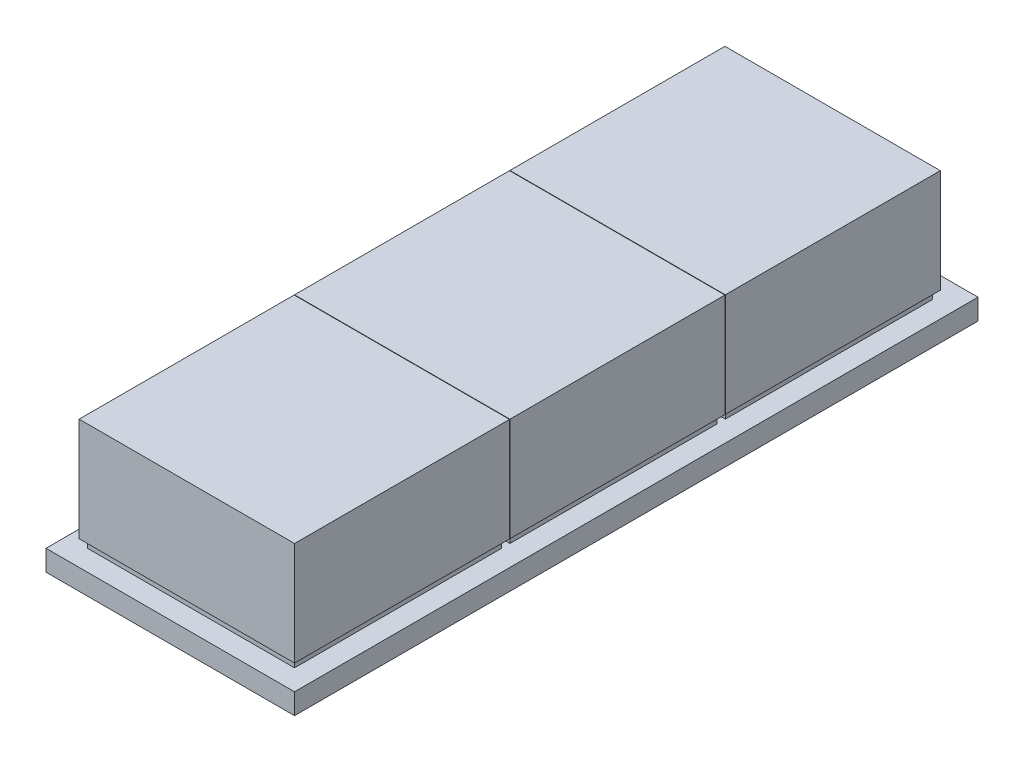
ISO-10303-21;
HEADER;
FILE_DESCRIPTION(('STEP AP214'),'2;1');
FILE_NAME('part.step','',(''),(''),'','','');
FILE_SCHEMA(('AUTOMOTIVE_DESIGN { 1 0 10303 214 1 1 1 1 }'));
ENDSEC;
DATA;
#1=APPLICATION_CONTEXT('core data for automotive mechanical design processes');
#2=APPLICATION_PROTOCOL_DEFINITION('international standard','automotive_design',2000,#1);
#3=PRODUCT_CONTEXT('',#1,'mechanical');
#4=PRODUCT('Part','Part','',(#3));
#5=PRODUCT_RELATED_PRODUCT_CATEGORY('part','',(#4));
#6=PRODUCT_DEFINITION_FORMATION('','',#4);
#7=PRODUCT_DEFINITION_CONTEXT('part definition',#1,'design');
#8=PRODUCT_DEFINITION('design','',#6,#7);
#9=PRODUCT_DEFINITION_SHAPE('','',#8);
#10=(LENGTH_UNIT() NAMED_UNIT(*) SI_UNIT(.MILLI.,.METRE.));
#11=(NAMED_UNIT(*) PLANE_ANGLE_UNIT() SI_UNIT($,.RADIAN.));
#12=(NAMED_UNIT(*) SI_UNIT($,.STERADIAN.) SOLID_ANGLE_UNIT());
#13=UNCERTAINTY_MEASURE_WITH_UNIT(LENGTH_MEASURE(1.E-05),#10,'distance_accuracy_value','');
#14=(GEOMETRIC_REPRESENTATION_CONTEXT(3) GLOBAL_UNCERTAINTY_ASSIGNED_CONTEXT((#13)) GLOBAL_UNIT_ASSIGNED_CONTEXT((#10,
#11,#12)) REPRESENTATION_CONTEXT('',''));
#15=CARTESIAN_POINT('',(0.,0.,0.));
#16=DIRECTION('',(0.,0.,1.));
#17=DIRECTION('',(1.,0.,0.));
#18=AXIS2_PLACEMENT_3D('',#15,#16,#17);
#19=CARTESIAN_POINT('',(-25.,7.,-26.5));
#20=DIRECTION('',(0.,0.,-1.));
#21=DIRECTION('',(-1.,0.,0.));
#22=AXIS2_PLACEMENT_3D('',#19,#20,#21);
#23=PLANE('',#22);
#24=DIRECTION('',(1.,0.,0.));
#25=VECTOR('',#24,1.);
#26=CARTESIAN_POINT('',(-25.,5.,-26.5));
#27=LINE('',#26,#25);
#28=CARTESIAN_POINT('',(-25.,5.,-26.5));
#29=VERTEX_POINT('',#28);
#30=CARTESIAN_POINT('',(25.,5.,-26.5));
#31=VERTEX_POINT('',#30);
#32=EDGE_CURVE('E416',#29,#31,#27,.T.);
#33=ORIENTED_EDGE('',*,*,#32,.T.);
#34=DIRECTION('',(0.,-1.,0.));
#35=VECTOR('',#34,1.);
#36=CARTESIAN_POINT('',(25.,7.,-26.5));
#37=LINE('',#36,#35);
#38=CARTESIAN_POINT('',(25.,7.,-26.5));
#39=VERTEX_POINT('',#38);
#40=EDGE_CURVE('E429',#39,#31,#37,.T.);
#41=ORIENTED_EDGE('',*,*,#40,.F.);
#42=DIRECTION('',(1.,0.,0.));
#43=VECTOR('',#42,1.);
#44=CARTESIAN_POINT('',(-25.,7.,-26.5));
#45=LINE('',#44,#43);
#46=CARTESIAN_POINT('',(-25.,7.,-26.5));
#47=VERTEX_POINT('',#46);
#48=EDGE_CURVE('E11',#47,#39,#45,.T.);
#49=ORIENTED_EDGE('',*,*,#48,.F.);
#50=DIRECTION('',(0.,-1.,0.));
#51=VECTOR('',#50,1.);
#52=CARTESIAN_POINT('',(-25.,7.,-26.5));
#53=LINE('',#52,#51);
#54=EDGE_CURVE('E49',#47,#29,#53,.T.);
#55=ORIENTED_EDGE('',*,*,#54,.T.);
#56=EDGE_LOOP('',(#33,#41,#49,#55));
#57=FACE_BOUND('',#56,.T.);
#58=ADVANCED_FACE('F35',(#57),#23,.F.);
#59=CARTESIAN_POINT('',(-25.,7.,-76.5));
#60=DIRECTION('',(1.,0.,0.));
#61=DIRECTION('',(0.,0.,-1.));
#62=AXIS2_PLACEMENT_3D('',#59,#60,#61);
#63=PLANE('',#62);
#64=DIRECTION('',(0.,0.,1.));
#65=VECTOR('',#64,1.);
#66=CARTESIAN_POINT('',(-25.,5.,-76.5));
#67=LINE('',#66,#65);
#68=CARTESIAN_POINT('',(-25.,5.,-76.5));
#69=VERTEX_POINT('',#68);
#70=EDGE_CURVE('E419',#69,#29,#67,.T.);
#71=ORIENTED_EDGE('',*,*,#70,.T.);
#72=ORIENTED_EDGE('',*,*,#54,.F.);
#73=DIRECTION('',(0.,0.,1.));
#74=VECTOR('',#73,1.);
#75=CARTESIAN_POINT('',(-25.,7.,-76.5));
#76=LINE('',#75,#74);
#77=CARTESIAN_POINT('',(-25.,7.,-76.5));
#78=VERTEX_POINT('',#77);
#79=EDGE_CURVE('E42',#78,#47,#76,.T.);
#80=ORIENTED_EDGE('',*,*,#79,.F.);
#81=DIRECTION('',(0.,-1.,0.));
#82=VECTOR('',#81,1.);
#83=CARTESIAN_POINT('',(-25.,7.,-76.5));
#84=LINE('',#83,#82);
#85=EDGE_CURVE('E57',#78,#69,#84,.T.);
#86=ORIENTED_EDGE('',*,*,#85,.T.);
#87=EDGE_LOOP('',(#71,#72,#80,#86));
#88=FACE_BOUND('',#87,.T.);
#89=ADVANCED_FACE('F439',(#88),#63,.F.);
#90=CARTESIAN_POINT('',(-25.,7.,-76.5));
#91=DIRECTION('',(0.,0.,1.));
#92=DIRECTION('',(1.,0.,0.));
#93=AXIS2_PLACEMENT_3D('',#90,#91,#92);
#94=PLANE('',#93);
#95=DIRECTION('',(-1.,0.,0.));
#96=VECTOR('',#95,1.);
#97=CARTESIAN_POINT('',(-25.,5.,-76.5));
#98=LINE('',#97,#96);
#99=CARTESIAN_POINT('',(25.,5.,-76.5));
#100=VERTEX_POINT('',#99);
#101=EDGE_CURVE('E421',#100,#69,#98,.T.);
#102=ORIENTED_EDGE('',*,*,#101,.T.);
#103=ORIENTED_EDGE('',*,*,#85,.F.);
#104=DIRECTION('',(-1.,0.,0.));
#105=VECTOR('',#104,1.);
#106=CARTESIAN_POINT('',(-25.,7.,-76.5));
#107=LINE('',#106,#105);
#108=CARTESIAN_POINT('',(25.,7.,-76.5));
#109=VERTEX_POINT('',#108);
#110=EDGE_CURVE('E433',#109,#78,#107,.T.);
#111=ORIENTED_EDGE('',*,*,#110,.F.);
#112=DIRECTION('',(0.,-1.,0.));
#113=VECTOR('',#112,1.);
#114=CARTESIAN_POINT('',(25.,7.,-76.5));
#115=LINE('',#114,#113);
#116=EDGE_CURVE('E423',#109,#100,#115,.T.);
#117=ORIENTED_EDGE('',*,*,#116,.T.);
#118=EDGE_LOOP('',(#102,#103,#111,#117));
#119=FACE_BOUND('',#118,.T.);
#120=ADVANCED_FACE('F446',(#119),#94,.F.);
#121=CARTESIAN_POINT('',(25.,7.,-76.5));
#122=DIRECTION('',(-1.,0.,0.));
#123=DIRECTION('',(0.,0.,1.));
#124=AXIS2_PLACEMENT_3D('',#121,#122,#123);
#125=PLANE('',#124);
#126=DIRECTION('',(0.,0.,-1.));
#127=VECTOR('',#126,1.);
#128=CARTESIAN_POINT('',(25.,5.,-76.5));
#129=LINE('',#128,#127);
#130=EDGE_CURVE('E414',#31,#100,#129,.T.);
#131=ORIENTED_EDGE('',*,*,#130,.T.);
#132=ORIENTED_EDGE('',*,*,#116,.F.);
#133=DIRECTION('',(0.,0.,-1.));
#134=VECTOR('',#133,1.);
#135=CARTESIAN_POINT('',(25.,7.,-76.5));
#136=LINE('',#135,#134);
#137=EDGE_CURVE('E426',#39,#109,#136,.T.);
#138=ORIENTED_EDGE('',*,*,#137,.F.);
#139=ORIENTED_EDGE('',*,*,#40,.T.);
#140=EDGE_LOOP('',(#131,#132,#138,#139));
#141=FACE_BOUND('',#140,.T.);
#142=ADVANCED_FACE('F445',(#141),#125,.F.);
#143=CARTESIAN_POINT('',(0.,5.,0.));
#144=DIRECTION('',(0.,-1.,0.));
#145=DIRECTION('',(0.,0.,-1.));
#146=AXIS2_PLACEMENT_3D('',#143,#144,#145);
#147=PLANE('',#146);
#148=DIRECTION('',(0.,0.,-1.));
#149=VECTOR('',#148,1.);
#150=CARTESIAN_POINT('',(25.,5.,27.5));
#151=LINE('',#150,#149);
#152=CARTESIAN_POINT('',(25.,5.,77.5));
#153=VERTEX_POINT('',#152);
#154=CARTESIAN_POINT('',(25.,5.,27.5));
#155=VERTEX_POINT('',#154);
#156=EDGE_CURVE('E348',#153,#155,#151,.T.);
#157=ORIENTED_EDGE('',*,*,#156,.F.);
#158=DIRECTION('',(1.,0.,0.));
#159=VECTOR('',#158,1.);
#160=CARTESIAN_POINT('',(-25.,5.,77.5));
#161=LINE('',#160,#159);
#162=CARTESIAN_POINT('',(-25.,5.,77.5));
#163=VERTEX_POINT('',#162);
#164=EDGE_CURVE('E353',#163,#153,#161,.T.);
#165=ORIENTED_EDGE('',*,*,#164,.F.);
#166=DIRECTION('',(0.,0.,1.));
#167=VECTOR('',#166,1.);
#168=CARTESIAN_POINT('',(-25.,5.,27.5));
#169=LINE('',#168,#167);
#170=CARTESIAN_POINT('',(-25.,5.,27.5));
#171=VERTEX_POINT('',#170);
#172=EDGE_CURVE('E368',#171,#163,#169,.T.);
#173=ORIENTED_EDGE('',*,*,#172,.F.);
#174=DIRECTION('',(-1.,0.,0.));
#175=VECTOR('',#174,1.);
#176=CARTESIAN_POINT('',(-25.,5.,27.5));
#177=LINE('',#176,#175);
#178=EDGE_CURVE('E365',#155,#171,#177,.T.);
#179=ORIENTED_EDGE('',*,*,#178,.F.);
#180=EDGE_LOOP('',(#157,#165,#173,#179));
#181=FACE_BOUND('',#180,.T.);
#182=DIRECTION('',(0.,0.,-1.));
#183=VECTOR('',#182,1.);
#184=CARTESIAN_POINT('',(30.,5.,82.5));
#185=LINE('',#184,#183);
#186=CARTESIAN_POINT('',(30.,5.,82.5));
#187=VERTEX_POINT('',#186);
#188=CARTESIAN_POINT('',(30.,5.,-82.5));
#189=VERTEX_POINT('',#188);
#190=EDGE_CURVE('E385',#187,#189,#185,.T.);
#191=ORIENTED_EDGE('',*,*,#190,.T.);
#192=DIRECTION('',(-1.,0.,0.));
#193=VECTOR('',#192,1.);
#194=CARTESIAN_POINT('',(-30.,5.,-82.5));
#195=LINE('',#194,#193);
#196=CARTESIAN_POINT('',(-30.,5.,-82.5));
#197=VERTEX_POINT('',#196);
#198=EDGE_CURVE('E388',#189,#197,#195,.T.);
#199=ORIENTED_EDGE('',*,*,#198,.T.);
#200=DIRECTION('',(0.,0.,1.));
#201=VECTOR('',#200,1.);
#202=CARTESIAN_POINT('',(-30.,5.,82.5));
#203=LINE('',#202,#201);
#204=CARTESIAN_POINT('',(-30.,5.,82.5));
#205=VERTEX_POINT('',#204);
#206=EDGE_CURVE('E391',#197,#205,#203,.T.);
#207=ORIENTED_EDGE('',*,*,#206,.T.);
#208=DIRECTION('',(1.,0.,0.));
#209=VECTOR('',#208,1.);
#210=CARTESIAN_POINT('',(-30.,5.,82.5));
#211=LINE('',#210,#209);
#212=EDGE_CURVE('E393',#205,#187,#211,.T.);
#213=ORIENTED_EDGE('',*,*,#212,.T.);
#214=EDGE_LOOP('',(#191,#199,#207,#213));
#215=FACE_BOUND('',#214,.T.);
#216=DIRECTION('',(0.,0.,-1.));
#217=VECTOR('',#216,1.);
#218=CARTESIAN_POINT('',(25.,5.,-24.5));
#219=LINE('',#218,#217);
#220=CARTESIAN_POINT('',(25.,5.,25.5));
#221=VERTEX_POINT('',#220);
#222=CARTESIAN_POINT('',(25.,5.,-24.5));
#223=VERTEX_POINT('',#222);
#224=EDGE_CURVE('E345',#221,#223,#219,.T.);
#225=ORIENTED_EDGE('',*,*,#224,.F.);
#226=DIRECTION('',(1.,0.,0.));
#227=VECTOR('',#226,1.);
#228=CARTESIAN_POINT('',(-25.,5.,25.5));
#229=LINE('',#228,#227);
#230=CARTESIAN_POINT('',(-25.,5.,25.5));
#231=VERTEX_POINT('',#230);
#232=EDGE_CURVE('E312',#231,#221,#229,.T.);
#233=ORIENTED_EDGE('',*,*,#232,.F.);
#234=DIRECTION('',(0.,0.,1.));
#235=VECTOR('',#234,1.);
#236=CARTESIAN_POINT('',(-25.,5.,-24.5));
#237=LINE('',#236,#235);
#238=CARTESIAN_POINT('',(-25.,5.,-24.5));
#239=VERTEX_POINT('',#238);
#240=EDGE_CURVE('E333',#239,#231,#237,.T.);
#241=ORIENTED_EDGE('',*,*,#240,.F.);
#242=DIRECTION('',(-1.,0.,0.));
#243=VECTOR('',#242,1.);
#244=CARTESIAN_POINT('',(-25.,5.,-24.5));
#245=LINE('',#244,#243);
#246=EDGE_CURVE('E339',#223,#239,#245,.T.);
#247=ORIENTED_EDGE('',*,*,#246,.F.);
#248=EDGE_LOOP('',(#225,#233,#241,#247));
#249=FACE_BOUND('',#248,.T.);
#250=ORIENTED_EDGE('',*,*,#130,.F.);
#251=ORIENTED_EDGE('',*,*,#32,.F.);
#252=ORIENTED_EDGE('',*,*,#70,.F.);
#253=ORIENTED_EDGE('',*,*,#101,.F.);
#254=EDGE_LOOP('',(#250,#251,#252,#253));
#255=FACE_BOUND('',#254,.T.);
#256=ADVANCED_FACE('F453',(#181,#215,#249,#255),#147,.F.);
#257=CARTESIAN_POINT('',(30.,5.,82.5));
#258=DIRECTION('',(-1.,0.,0.));
#259=DIRECTION('',(0.,0.,1.));
#260=AXIS2_PLACEMENT_3D('',#257,#258,#259);
#261=PLANE('',#260);
#262=DIRECTION('',(0.,0.,-1.));
#263=VECTOR('',#262,1.);
#264=CARTESIAN_POINT('',(30.,0.,82.5));
#265=LINE('',#264,#263);
#266=CARTESIAN_POINT('',(30.,0.,82.5));
#267=VERTEX_POINT('',#266);
#268=CARTESIAN_POINT('',(30.,0.,-82.5));
#269=VERTEX_POINT('',#268);
#270=EDGE_CURVE('E384',#267,#269,#265,.T.);
#271=ORIENTED_EDGE('',*,*,#270,.T.);
#272=DIRECTION('',(0.,-1.,0.));
#273=VECTOR('',#272,1.);
#274=CARTESIAN_POINT('',(30.,5.,-82.5));
#275=LINE('',#274,#273);
#276=EDGE_CURVE('E411',#189,#269,#275,.T.);
#277=ORIENTED_EDGE('',*,*,#276,.F.);
#278=ORIENTED_EDGE('',*,*,#190,.F.);
#279=DIRECTION('',(0.,-1.,0.));
#280=VECTOR('',#279,1.);
#281=CARTESIAN_POINT('',(30.,5.,82.5));
#282=LINE('',#281,#280);
#283=EDGE_CURVE('E395',#187,#267,#282,.T.);
#284=ORIENTED_EDGE('',*,*,#283,.T.);
#285=EDGE_LOOP('',(#271,#277,#278,#284));
#286=FACE_BOUND('',#285,.T.);
#287=ADVANCED_FACE('F734',(#286),#261,.F.);
#288=CARTESIAN_POINT('',(-30.,5.,-82.5));
#289=DIRECTION('',(0.,0.,1.));
#290=DIRECTION('',(1.,0.,0.));
#291=AXIS2_PLACEMENT_3D('',#288,#289,#290);
#292=PLANE('',#291);
#293=DIRECTION('',(-1.,0.,0.));
#294=VECTOR('',#293,1.);
#295=CARTESIAN_POINT('',(-30.,0.,-82.5));
#296=LINE('',#295,#294);
#297=CARTESIAN_POINT('',(-30.,0.,-82.5));
#298=VERTEX_POINT('',#297);
#299=EDGE_CURVE('E398',#269,#298,#296,.T.);
#300=ORIENTED_EDGE('',*,*,#299,.T.);
#301=DIRECTION('',(0.,-1.,0.));
#302=VECTOR('',#301,1.);
#303=CARTESIAN_POINT('',(-30.,5.,-82.5));
#304=LINE('',#303,#302);
#305=EDGE_CURVE('E408',#197,#298,#304,.T.);
#306=ORIENTED_EDGE('',*,*,#305,.F.);
#307=ORIENTED_EDGE('',*,*,#198,.F.);
#308=ORIENTED_EDGE('',*,*,#276,.T.);
#309=EDGE_LOOP('',(#300,#306,#307,#308));
#310=FACE_BOUND('',#309,.T.);
#311=ADVANCED_FACE('F795',(#310),#292,.F.);
#312=CARTESIAN_POINT('',(-30.,5.,82.5));
#313=DIRECTION('',(1.,0.,0.));
#314=DIRECTION('',(0.,0.,-1.));
#315=AXIS2_PLACEMENT_3D('',#312,#313,#314);
#316=PLANE('',#315);
#317=DIRECTION('',(0.,0.,1.));
#318=VECTOR('',#317,1.);
#319=CARTESIAN_POINT('',(-30.,0.,82.5));
#320=LINE('',#319,#318);
#321=CARTESIAN_POINT('',(-30.,0.,82.5));
#322=VERTEX_POINT('',#321);
#323=EDGE_CURVE('E400',#298,#322,#320,.T.);
#324=ORIENTED_EDGE('',*,*,#323,.T.);
#325=DIRECTION('',(0.,-1.,0.));
#326=VECTOR('',#325,1.);
#327=CARTESIAN_POINT('',(-30.,5.,82.5));
#328=LINE('',#327,#326);
#329=EDGE_CURVE('E405',#205,#322,#328,.T.);
#330=ORIENTED_EDGE('',*,*,#329,.F.);
#331=ORIENTED_EDGE('',*,*,#206,.F.);
#332=ORIENTED_EDGE('',*,*,#305,.T.);
#333=EDGE_LOOP('',(#324,#330,#331,#332));
#334=FACE_BOUND('',#333,.T.);
#335=ADVANCED_FACE('F786',(#334),#316,.F.);
#336=CARTESIAN_POINT('',(-30.,5.,82.5));
#337=DIRECTION('',(0.,0.,-1.));
#338=DIRECTION('',(-1.,0.,0.));
#339=AXIS2_PLACEMENT_3D('',#336,#337,#338);
#340=PLANE('',#339);
#341=DIRECTION('',(1.,0.,0.));
#342=VECTOR('',#341,1.);
#343=CARTESIAN_POINT('',(-30.,0.,82.5));
#344=LINE('',#343,#342);
#345=EDGE_CURVE('E389',#322,#267,#344,.T.);
#346=ORIENTED_EDGE('',*,*,#345,.T.);
#347=ORIENTED_EDGE('',*,*,#283,.F.);
#348=ORIENTED_EDGE('',*,*,#212,.F.);
#349=ORIENTED_EDGE('',*,*,#329,.T.);
#350=EDGE_LOOP('',(#346,#347,#348,#349));
#351=FACE_BOUND('',#350,.T.);
#352=ADVANCED_FACE('F777',(#351),#340,.F.);
#353=CARTESIAN_POINT('',(0.,0.,0.));
#354=DIRECTION('',(0.,-1.,0.));
#355=DIRECTION('',(0.,0.,-1.));
#356=AXIS2_PLACEMENT_3D('',#353,#354,#355);
#357=PLANE('',#356);
#358=ORIENTED_EDGE('',*,*,#270,.F.);
#359=ORIENTED_EDGE('',*,*,#345,.F.);
#360=ORIENTED_EDGE('',*,*,#323,.F.);
#361=ORIENTED_EDGE('',*,*,#299,.F.);
#362=EDGE_LOOP('',(#358,#359,#360,#361));
#363=FACE_BOUND('',#362,.T.);
#364=ADVANCED_FACE('F769',(#363),#357,.T.);
#365=CARTESIAN_POINT('',(25.,7.,27.5));
#366=DIRECTION('',(-1.,0.,0.));
#367=DIRECTION('',(0.,0.,1.));
#368=AXIS2_PLACEMENT_3D('',#365,#366,#367);
#369=PLANE('',#368);
#370=ORIENTED_EDGE('',*,*,#156,.T.);
#371=DIRECTION('',(0.,-1.,0.));
#372=VECTOR('',#371,1.);
#373=CARTESIAN_POINT('',(25.,7.,27.5));
#374=LINE('',#373,#372);
#375=CARTESIAN_POINT('',(25.,7.,27.5));
#376=VERTEX_POINT('',#375);
#377=EDGE_CURVE('E381',#376,#155,#374,.T.);
#378=ORIENTED_EDGE('',*,*,#377,.F.);
#379=DIRECTION('',(0.,0.,-1.));
#380=VECTOR('',#379,1.);
#381=CARTESIAN_POINT('',(25.,7.,27.5));
#382=LINE('',#381,#380);
#383=CARTESIAN_POINT('',(25.,7.,77.5));
#384=VERTEX_POINT('',#383);
#385=EDGE_CURVE('E349',#384,#376,#382,.T.);
#386=ORIENTED_EDGE('',*,*,#385,.F.);
#387=DIRECTION('',(0.,-1.,0.));
#388=VECTOR('',#387,1.);
#389=CARTESIAN_POINT('',(25.,7.,77.5));
#390=LINE('',#389,#388);
#391=EDGE_CURVE('E362',#384,#153,#390,.T.);
#392=ORIENTED_EDGE('',*,*,#391,.T.);
#393=EDGE_LOOP('',(#370,#378,#386,#392));
#394=FACE_BOUND('',#393,.T.);
#395=ADVANCED_FACE('F761',(#394),#369,.F.);
#396=CARTESIAN_POINT('',(-25.,7.,27.5));
#397=DIRECTION('',(0.,0.,1.));
#398=DIRECTION('',(1.,0.,0.));
#399=AXIS2_PLACEMENT_3D('',#396,#397,#398);
#400=PLANE('',#399);
#401=ORIENTED_EDGE('',*,*,#178,.T.);
#402=DIRECTION('',(0.,-1.,0.));
#403=VECTOR('',#402,1.);
#404=CARTESIAN_POINT('',(-25.,7.,27.5));
#405=LINE('',#404,#403);
#406=CARTESIAN_POINT('',(-25.,7.,27.5));
#407=VERTEX_POINT('',#406);
#408=EDGE_CURVE('E378',#407,#171,#405,.T.);
#409=ORIENTED_EDGE('',*,*,#408,.F.);
#410=DIRECTION('',(-1.,0.,0.));
#411=VECTOR('',#410,1.);
#412=CARTESIAN_POINT('',(-25.,7.,27.5));
#413=LINE('',#412,#411);
#414=EDGE_CURVE('E352',#376,#407,#413,.T.);
#415=ORIENTED_EDGE('',*,*,#414,.F.);
#416=ORIENTED_EDGE('',*,*,#377,.T.);
#417=EDGE_LOOP('',(#401,#409,#415,#416));
#418=FACE_BOUND('',#417,.T.);
#419=ADVANCED_FACE('F752',(#418),#400,.F.);
#420=CARTESIAN_POINT('',(-25.,7.,27.5));
#421=DIRECTION('',(1.,0.,0.));
#422=DIRECTION('',(0.,0.,-1.));
#423=AXIS2_PLACEMENT_3D('',#420,#421,#422);
#424=PLANE('',#423);
#425=ORIENTED_EDGE('',*,*,#172,.T.);
#426=DIRECTION('',(0.,-1.,0.));
#427=VECTOR('',#426,1.);
#428=CARTESIAN_POINT('',(-25.,7.,77.5));
#429=LINE('',#428,#427);
#430=CARTESIAN_POINT('',(-25.,7.,77.5));
#431=VERTEX_POINT('',#430);
#432=EDGE_CURVE('E375',#431,#163,#429,.T.);
#433=ORIENTED_EDGE('',*,*,#432,.F.);
#434=DIRECTION('',(0.,0.,1.));
#435=VECTOR('',#434,1.);
#436=CARTESIAN_POINT('',(-25.,7.,27.5));
#437=LINE('',#436,#435);
#438=EDGE_CURVE('E356',#407,#431,#437,.T.);
#439=ORIENTED_EDGE('',*,*,#438,.F.);
#440=ORIENTED_EDGE('',*,*,#408,.T.);
#441=EDGE_LOOP('',(#425,#433,#439,#440));
#442=FACE_BOUND('',#441,.T.);
#443=ADVANCED_FACE('F743',(#442),#424,.F.);
#444=CARTESIAN_POINT('',(-25.,7.,77.5));
#445=DIRECTION('',(0.,0.,-1.));
#446=DIRECTION('',(-1.,0.,0.));
#447=AXIS2_PLACEMENT_3D('',#444,#445,#446);
#448=PLANE('',#447);
#449=ORIENTED_EDGE('',*,*,#164,.T.);
#450=ORIENTED_EDGE('',*,*,#391,.F.);
#451=DIRECTION('',(1.,0.,0.));
#452=VECTOR('',#451,1.);
#453=CARTESIAN_POINT('',(-25.,7.,77.5));
#454=LINE('',#453,#452);
#455=EDGE_CURVE('E359',#431,#384,#454,.T.);
#456=ORIENTED_EDGE('',*,*,#455,.F.);
#457=ORIENTED_EDGE('',*,*,#432,.T.);
#458=EDGE_LOOP('',(#449,#450,#456,#457));
#459=FACE_BOUND('',#458,.T.);
#460=ADVANCED_FACE('F480',(#459),#448,.F.);
#461=CARTESIAN_POINT('',(25.,7.,-24.5));
#462=DIRECTION('',(-1.,0.,0.));
#463=DIRECTION('',(0.,0.,1.));
#464=AXIS2_PLACEMENT_3D('',#461,#462,#463);
#465=PLANE('',#464);
#466=ORIENTED_EDGE('',*,*,#224,.T.);
#467=DIRECTION('',(0.,-1.,0.));
#468=VECTOR('',#467,1.);
#469=CARTESIAN_POINT('',(25.,7.,-24.5));
#470=LINE('',#469,#468);
#471=CARTESIAN_POINT('',(25.,7.,-24.5));
#472=VERTEX_POINT('',#471);
#473=EDGE_CURVE('E342',#472,#223,#470,.T.);
#474=ORIENTED_EDGE('',*,*,#473,.F.);
#475=DIRECTION('',(0.,0.,-1.));
#476=VECTOR('',#475,1.);
#477=CARTESIAN_POINT('',(25.,7.,-24.5));
#478=LINE('',#477,#476);
#479=CARTESIAN_POINT('',(25.,7.,25.5));
#480=VERTEX_POINT('',#479);
#481=EDGE_CURVE('E315',#480,#472,#478,.T.);
#482=ORIENTED_EDGE('',*,*,#481,.F.);
#483=DIRECTION('',(0.,-1.,0.));
#484=VECTOR('',#483,1.);
#485=CARTESIAN_POINT('',(25.,7.,25.5));
#486=LINE('',#485,#484);
#487=EDGE_CURVE('E327',#480,#221,#486,.T.);
#488=ORIENTED_EDGE('',*,*,#487,.T.);
#489=EDGE_LOOP('',(#466,#474,#482,#488));
#490=FACE_BOUND('',#489,.T.);
#491=ADVANCED_FACE('F474',(#490),#465,.F.);
#492=CARTESIAN_POINT('',(-25.,7.,-24.5));
#493=DIRECTION('',(0.,0.,1.));
#494=DIRECTION('',(1.,0.,0.));
#495=AXIS2_PLACEMENT_3D('',#492,#493,#494);
#496=PLANE('',#495);
#497=ORIENTED_EDGE('',*,*,#246,.T.);
#498=DIRECTION('',(0.,-1.,0.));
#499=VECTOR('',#498,1.);
#500=CARTESIAN_POINT('',(-25.,7.,-24.5));
#501=LINE('',#500,#499);
#502=CARTESIAN_POINT('',(-25.,7.,-24.5));
#503=VERTEX_POINT('',#502);
#504=EDGE_CURVE('E336',#503,#239,#501,.T.);
#505=ORIENTED_EDGE('',*,*,#504,.F.);
#506=DIRECTION('',(-1.,0.,0.));
#507=VECTOR('',#506,1.);
#508=CARTESIAN_POINT('',(-25.,7.,-24.5));
#509=LINE('',#508,#507);
#510=EDGE_CURVE('E318',#472,#503,#509,.T.);
#511=ORIENTED_EDGE('',*,*,#510,.F.);
#512=ORIENTED_EDGE('',*,*,#473,.T.);
#513=EDGE_LOOP('',(#497,#505,#511,#512));
#514=FACE_BOUND('',#513,.T.);
#515=ADVANCED_FACE('F479',(#514),#496,.F.);
#516=CARTESIAN_POINT('',(-25.,7.,-24.5));
#517=DIRECTION('',(1.,0.,0.));
#518=DIRECTION('',(0.,0.,-1.));
#519=AXIS2_PLACEMENT_3D('',#516,#517,#518);
#520=PLANE('',#519);
#521=ORIENTED_EDGE('',*,*,#240,.T.);
#522=DIRECTION('',(0.,-1.,0.));
#523=VECTOR('',#522,1.);
#524=CARTESIAN_POINT('',(-25.,7.,25.5));
#525=LINE('',#524,#523);
#526=CARTESIAN_POINT('',(-25.,7.,25.5));
#527=VERTEX_POINT('',#526);
#528=EDGE_CURVE('E330',#527,#231,#525,.T.);
#529=ORIENTED_EDGE('',*,*,#528,.F.);
#530=DIRECTION('',(0.,0.,1.));
#531=VECTOR('',#530,1.);
#532=CARTESIAN_POINT('',(-25.,7.,-24.5));
#533=LINE('',#532,#531);
#534=EDGE_CURVE('E321',#503,#527,#533,.T.);
#535=ORIENTED_EDGE('',*,*,#534,.F.);
#536=ORIENTED_EDGE('',*,*,#504,.T.);
#537=EDGE_LOOP('',(#521,#529,#535,#536));
#538=FACE_BOUND('',#537,.T.);
#539=ADVANCED_FACE('F489',(#538),#520,.F.);
#540=CARTESIAN_POINT('',(-25.,7.,25.5));
#541=DIRECTION('',(0.,0.,-1.));
#542=DIRECTION('',(-1.,0.,0.));
#543=AXIS2_PLACEMENT_3D('',#540,#541,#542);
#544=PLANE('',#543);
#545=ORIENTED_EDGE('',*,*,#232,.T.);
#546=ORIENTED_EDGE('',*,*,#487,.F.);
#547=DIRECTION('',(1.,0.,0.));
#548=VECTOR('',#547,1.);
#549=CARTESIAN_POINT('',(-25.,7.,25.5));
#550=LINE('',#549,#548);
#551=EDGE_CURVE('E324',#527,#480,#550,.T.);
#552=ORIENTED_EDGE('',*,*,#551,.F.);
#553=ORIENTED_EDGE('',*,*,#528,.T.);
#554=EDGE_LOOP('',(#545,#546,#552,#553));
#555=FACE_BOUND('',#554,.T.);
#556=ADVANCED_FACE('F494',(#555),#544,.F.);
#557=CARTESIAN_POINT('',(0.,7.,0.));
#558=DIRECTION('',(0.,1.,0.));
#559=DIRECTION('',(0.,0.,1.));
#560=AXIS2_PLACEMENT_3D('',#557,#558,#559);
#561=PLANE('',#560);
#562=DIRECTION('',(0.,0.,-1.));
#563=VECTOR('',#562,1.);
#564=CARTESIAN_POINT('',(26.,7.,26.6));
#565=LINE('',#564,#563);
#566=CARTESIAN_POINT('',(26.,7.,78.5));
#567=VERTEX_POINT('',#566);
#568=CARTESIAN_POINT('',(26.,7.,26.6));
#569=VERTEX_POINT('',#568);
#570=EDGE_CURVE('E282',#567,#569,#565,.T.);
#571=ORIENTED_EDGE('',*,*,#570,.F.);
#572=DIRECTION('',(1.,0.,0.));
#573=VECTOR('',#572,1.);
#574=CARTESIAN_POINT('',(-26.,7.,78.5));
#575=LINE('',#574,#573);
#576=CARTESIAN_POINT('',(-26.,7.,78.5));
#577=VERTEX_POINT('',#576);
#578=EDGE_CURVE('E287',#577,#567,#575,.T.);
#579=ORIENTED_EDGE('',*,*,#578,.F.);
#580=DIRECTION('',(0.,0.,1.));
#581=VECTOR('',#580,1.);
#582=CARTESIAN_POINT('',(-26.,7.,26.6));
#583=LINE('',#582,#581);
#584=CARTESIAN_POINT('',(-26.,7.,26.6));
#585=VERTEX_POINT('',#584);
#586=EDGE_CURVE('E298',#585,#577,#583,.T.);
#587=ORIENTED_EDGE('',*,*,#586,.F.);
#588=DIRECTION('',(-1.,0.,0.));
#589=VECTOR('',#588,1.);
#590=CARTESIAN_POINT('',(-26.,7.,26.6));
#591=LINE('',#590,#589);
#592=EDGE_CURVE('E296',#569,#585,#591,.T.);
#593=ORIENTED_EDGE('',*,*,#592,.F.);
#594=EDGE_LOOP('',(#571,#579,#587,#593));
#595=FACE_BOUND('',#594,.T.);
#596=ORIENTED_EDGE('',*,*,#455,.T.);
#597=ORIENTED_EDGE('',*,*,#385,.T.);
#598=ORIENTED_EDGE('',*,*,#414,.T.);
#599=ORIENTED_EDGE('',*,*,#438,.T.);
#600=EDGE_LOOP('',(#596,#597,#598,#599));
#601=FACE_BOUND('',#600,.T.);
#602=ADVANCED_FACE('F620',(#595,#601),#561,.F.);
#603=CARTESIAN_POINT('',(26.,32.,26.6));
#604=DIRECTION('',(-1.,0.,0.));
#605=DIRECTION('',(0.,0.,1.));
#606=AXIS2_PLACEMENT_3D('',#603,#604,#605);
#607=PLANE('',#606);
#608=ORIENTED_EDGE('',*,*,#570,.T.);
#609=DIRECTION('',(0.,-1.,0.));
#610=VECTOR('',#609,1.);
#611=CARTESIAN_POINT('',(26.,32.,26.6));
#612=LINE('',#611,#610);
#613=CARTESIAN_POINT('',(26.,32.,26.6));
#614=VERTEX_POINT('',#613);
#615=EDGE_CURVE('E309',#614,#569,#612,.T.);
#616=ORIENTED_EDGE('',*,*,#615,.F.);
#617=DIRECTION('',(0.,0.,-1.));
#618=VECTOR('',#617,1.);
#619=CARTESIAN_POINT('',(26.,32.,26.6));
#620=LINE('',#619,#618);
#621=CARTESIAN_POINT('',(26.,32.,78.5));
#622=VERTEX_POINT('',#621);
#623=EDGE_CURVE('E283',#622,#614,#620,.T.);
#624=ORIENTED_EDGE('',*,*,#623,.F.);
#625=DIRECTION('',(0.,-1.,0.));
#626=VECTOR('',#625,1.);
#627=CARTESIAN_POINT('',(26.,32.,78.5));
#628=LINE('',#627,#626);
#629=EDGE_CURVE('E293',#622,#567,#628,.T.);
#630=ORIENTED_EDGE('',*,*,#629,.T.);
#631=EDGE_LOOP('',(#608,#616,#624,#630));
#632=FACE_BOUND('',#631,.T.);
#633=ADVANCED_FACE('F689',(#632),#607,.F.);
#634=CARTESIAN_POINT('',(-26.,32.,26.6));
#635=DIRECTION('',(0.,0.,1.));
#636=DIRECTION('',(1.,0.,0.));
#637=AXIS2_PLACEMENT_3D('',#634,#635,#636);
#638=PLANE('',#637);
#639=ORIENTED_EDGE('',*,*,#592,.T.);
#640=DIRECTION('',(0.,-1.,0.));
#641=VECTOR('',#640,1.);
#642=CARTESIAN_POINT('',(-26.,32.,26.6));
#643=LINE('',#642,#641);
#644=CARTESIAN_POINT('',(-26.,32.,26.6));
#645=VERTEX_POINT('',#644);
#646=EDGE_CURVE('E306',#645,#585,#643,.T.);
#647=ORIENTED_EDGE('',*,*,#646,.F.);
#648=DIRECTION('',(-1.,0.,0.));
#649=VECTOR('',#648,1.);
#650=CARTESIAN_POINT('',(-26.,32.,26.6));
#651=LINE('',#650,#649);
#652=EDGE_CURVE('E286',#614,#645,#651,.T.);
#653=ORIENTED_EDGE('',*,*,#652,.F.);
#654=ORIENTED_EDGE('',*,*,#615,.T.);
#655=EDGE_LOOP('',(#639,#647,#653,#654));
#656=FACE_BOUND('',#655,.T.);
#657=ADVANCED_FACE('F680',(#656),#638,.F.);
#658=CARTESIAN_POINT('',(-26.,32.,26.6));
#659=DIRECTION('',(1.,0.,0.));
#660=DIRECTION('',(0.,0.,-1.));
#661=AXIS2_PLACEMENT_3D('',#658,#659,#660);
#662=PLANE('',#661);
#663=ORIENTED_EDGE('',*,*,#586,.T.);
#664=DIRECTION('',(0.,-1.,0.));
#665=VECTOR('',#664,1.);
#666=CARTESIAN_POINT('',(-26.,32.,78.5));
#667=LINE('',#666,#665);
#668=CARTESIAN_POINT('',(-26.,32.,78.5));
#669=VERTEX_POINT('',#668);
#670=EDGE_CURVE('E303',#669,#577,#667,.T.);
#671=ORIENTED_EDGE('',*,*,#670,.F.);
#672=DIRECTION('',(0.,0.,1.));
#673=VECTOR('',#672,1.);
#674=CARTESIAN_POINT('',(-26.,32.,26.6));
#675=LINE('',#674,#673);
#676=EDGE_CURVE('E289',#645,#669,#675,.T.);
#677=ORIENTED_EDGE('',*,*,#676,.F.);
#678=ORIENTED_EDGE('',*,*,#646,.T.);
#679=EDGE_LOOP('',(#663,#671,#677,#678));
#680=FACE_BOUND('',#679,.T.);
#681=ADVANCED_FACE('F671',(#680),#662,.F.);
#682=CARTESIAN_POINT('',(-26.,32.,78.5));
#683=DIRECTION('',(0.,0.,-1.));
#684=DIRECTION('',(-1.,0.,0.));
#685=AXIS2_PLACEMENT_3D('',#682,#683,#684);
#686=PLANE('',#685);
#687=ORIENTED_EDGE('',*,*,#578,.T.);
#688=ORIENTED_EDGE('',*,*,#629,.F.);
#689=DIRECTION('',(1.,0.,0.));
#690=VECTOR('',#689,1.);
#691=CARTESIAN_POINT('',(-26.,32.,78.5));
#692=LINE('',#691,#690);
#693=EDGE_CURVE('E291',#669,#622,#692,.T.);
#694=ORIENTED_EDGE('',*,*,#693,.F.);
#695=ORIENTED_EDGE('',*,*,#670,.T.);
#696=EDGE_LOOP('',(#687,#688,#694,#695));
#697=FACE_BOUND('',#696,.T.);
#698=ADVANCED_FACE('F662',(#697),#686,.F.);
#699=CARTESIAN_POINT('',(0.,32.,0.));
#700=DIRECTION('',(0.,1.,0.));
#701=DIRECTION('',(0.,0.,1.));
#702=AXIS2_PLACEMENT_3D('',#699,#700,#701);
#703=PLANE('',#702);
#704=ORIENTED_EDGE('',*,*,#623,.T.);
#705=ORIENTED_EDGE('',*,*,#652,.T.);
#706=ORIENTED_EDGE('',*,*,#676,.T.);
#707=ORIENTED_EDGE('',*,*,#693,.T.);
#708=EDGE_LOOP('',(#704,#705,#706,#707));
#709=FACE_BOUND('',#708,.T.);
#710=ADVANCED_FACE('F575',(#709),#703,.T.);
#711=CARTESIAN_POINT('',(0.,7.,-52.));
#712=DIRECTION('',(0.,1.,0.));
#713=DIRECTION('',(0.,0.,1.));
#714=AXIS2_PLACEMENT_3D('',#711,#712,#713);
#715=PLANE('',#714);
#716=DIRECTION('',(0.,0.,-1.));
#717=VECTOR('',#716,1.);
#718=CARTESIAN_POINT('',(26.,7.,-25.4));
#719=LINE('',#718,#717);
#720=CARTESIAN_POINT('',(26.,7.,26.5));
#721=VERTEX_POINT('',#720);
#722=CARTESIAN_POINT('',(26.,7.,-25.4));
#723=VERTEX_POINT('',#722);
#724=EDGE_CURVE('E247',#721,#723,#719,.T.);
#725=ORIENTED_EDGE('',*,*,#724,.F.);
#726=DIRECTION('',(1.,0.,0.));
#727=VECTOR('',#726,1.);
#728=CARTESIAN_POINT('',(-26.,7.,26.5));
#729=LINE('',#728,#727);
#730=CARTESIAN_POINT('',(-26.,7.,26.5));
#731=VERTEX_POINT('',#730);
#732=EDGE_CURVE('E260',#731,#721,#729,.T.);
#733=ORIENTED_EDGE('',*,*,#732,.F.);
#734=DIRECTION('',(0.,0.,1.));
#735=VECTOR('',#734,1.);
#736=CARTESIAN_POINT('',(-26.,7.,-25.4));
#737=LINE('',#736,#735);
#738=CARTESIAN_POINT('',(-26.,7.,-25.4));
#739=VERTEX_POINT('',#738);
#740=EDGE_CURVE('E268',#739,#731,#737,.T.);
#741=ORIENTED_EDGE('',*,*,#740,.F.);
#742=DIRECTION('',(-1.,0.,0.));
#743=VECTOR('',#742,1.);
#744=CARTESIAN_POINT('',(-26.,7.,-25.4));
#745=LINE('',#744,#743);
#746=EDGE_CURVE('E250',#723,#739,#745,.T.);
#747=ORIENTED_EDGE('',*,*,#746,.F.);
#748=EDGE_LOOP('',(#725,#733,#741,#747));
#749=FACE_BOUND('',#748,.T.);
#750=ORIENTED_EDGE('',*,*,#551,.T.);
#751=ORIENTED_EDGE('',*,*,#481,.T.);
#752=ORIENTED_EDGE('',*,*,#510,.T.);
#753=ORIENTED_EDGE('',*,*,#534,.T.);
#754=EDGE_LOOP('',(#750,#751,#752,#753));
#755=FACE_BOUND('',#754,.T.);
#756=ADVANCED_FACE('F569',(#749,#755),#715,.F.);
#757=CARTESIAN_POINT('',(26.,32.,-25.4));
#758=DIRECTION('',(-1.,0.,0.));
#759=DIRECTION('',(0.,0.,1.));
#760=AXIS2_PLACEMENT_3D('',#757,#758,#759);
#761=PLANE('',#760);
#762=ORIENTED_EDGE('',*,*,#724,.T.);
#763=DIRECTION('',(0.,-1.,0.));
#764=VECTOR('',#763,1.);
#765=CARTESIAN_POINT('',(26.,32.,-25.4));
#766=LINE('',#765,#764);
#767=CARTESIAN_POINT('',(26.,32.,-25.4));
#768=VERTEX_POINT('',#767);
#769=EDGE_CURVE('E279',#768,#723,#766,.T.);
#770=ORIENTED_EDGE('',*,*,#769,.F.);
#771=DIRECTION('',(0.,0.,-1.));
#772=VECTOR('',#771,1.);
#773=CARTESIAN_POINT('',(26.,32.,-25.4));
#774=LINE('',#773,#772);
#775=CARTESIAN_POINT('',(26.,32.,26.5));
#776=VERTEX_POINT('',#775);
#777=EDGE_CURVE('E256',#776,#768,#774,.T.);
#778=ORIENTED_EDGE('',*,*,#777,.F.);
#779=DIRECTION('',(0.,-1.,0.));
#780=VECTOR('',#779,1.);
#781=CARTESIAN_POINT('',(26.,32.,26.5));
#782=LINE('',#781,#780);
#783=EDGE_CURVE('E265',#776,#721,#782,.T.);
#784=ORIENTED_EDGE('',*,*,#783,.T.);
#785=EDGE_LOOP('',(#762,#770,#778,#784));
#786=FACE_BOUND('',#785,.T.);
#787=ADVANCED_FACE('F574',(#786),#761,.F.);
#788=CARTESIAN_POINT('',(-26.,32.,-25.4));
#789=DIRECTION('',(0.,0.,1.));
#790=DIRECTION('',(1.,0.,0.));
#791=AXIS2_PLACEMENT_3D('',#788,#789,#790);
#792=PLANE('',#791);
#793=ORIENTED_EDGE('',*,*,#746,.T.);
#794=DIRECTION('',(0.,-1.,0.));
#795=VECTOR('',#794,1.);
#796=CARTESIAN_POINT('',(-26.,32.,-25.4));
#797=LINE('',#796,#795);
#798=CARTESIAN_POINT('',(-26.,32.,-25.4));
#799=VERTEX_POINT('',#798);
#800=EDGE_CURVE('E276',#799,#739,#797,.T.);
#801=ORIENTED_EDGE('',*,*,#800,.F.);
#802=DIRECTION('',(-1.,0.,0.));
#803=VECTOR('',#802,1.);
#804=CARTESIAN_POINT('',(-26.,32.,-25.4));
#805=LINE('',#804,#803);
#806=EDGE_CURVE('E259',#768,#799,#805,.T.);
#807=ORIENTED_EDGE('',*,*,#806,.F.);
#808=ORIENTED_EDGE('',*,*,#769,.T.);
#809=EDGE_LOOP('',(#793,#801,#807,#808));
#810=FACE_BOUND('',#809,.T.);
#811=ADVANCED_FACE('F603',(#810),#792,.F.);
#812=CARTESIAN_POINT('',(-26.,32.,-25.4));
#813=DIRECTION('',(1.,0.,0.));
#814=DIRECTION('',(0.,0.,-1.));
#815=AXIS2_PLACEMENT_3D('',#812,#813,#814);
#816=PLANE('',#815);
#817=ORIENTED_EDGE('',*,*,#740,.T.);
#818=DIRECTION('',(0.,-1.,0.));
#819=VECTOR('',#818,1.);
#820=CARTESIAN_POINT('',(-26.,32.,26.5));
#821=LINE('',#820,#819);
#822=CARTESIAN_POINT('',(-26.,32.,26.5));
#823=VERTEX_POINT('',#822);
#824=EDGE_CURVE('E273',#823,#731,#821,.T.);
#825=ORIENTED_EDGE('',*,*,#824,.F.);
#826=DIRECTION('',(0.,0.,1.));
#827=VECTOR('',#826,1.);
#828=CARTESIAN_POINT('',(-26.,32.,-25.4));
#829=LINE('',#828,#827);
#830=EDGE_CURVE('E262',#799,#823,#829,.T.);
#831=ORIENTED_EDGE('',*,*,#830,.F.);
#832=ORIENTED_EDGE('',*,*,#800,.T.);
#833=EDGE_LOOP('',(#817,#825,#831,#832));
#834=FACE_BOUND('',#833,.T.);
#835=ADVANCED_FACE('F586',(#834),#816,.F.);
#836=CARTESIAN_POINT('',(-26.,32.,26.5));
#837=DIRECTION('',(0.,0.,-1.));
#838=DIRECTION('',(-1.,0.,0.));
#839=AXIS2_PLACEMENT_3D('',#836,#837,#838);
#840=PLANE('',#839);
#841=ORIENTED_EDGE('',*,*,#732,.T.);
#842=ORIENTED_EDGE('',*,*,#783,.F.);
#843=DIRECTION('',(1.,0.,0.));
#844=VECTOR('',#843,1.);
#845=CARTESIAN_POINT('',(-26.,32.,26.5));
#846=LINE('',#845,#844);
#847=EDGE_CURVE('E264',#823,#776,#846,.T.);
#848=ORIENTED_EDGE('',*,*,#847,.F.);
#849=ORIENTED_EDGE('',*,*,#824,.T.);
#850=EDGE_LOOP('',(#841,#842,#848,#849));
#851=FACE_BOUND('',#850,.T.);
#852=ADVANCED_FACE('F561',(#851),#840,.F.);
#853=CARTESIAN_POINT('',(0.,32.,-52.));
#854=DIRECTION('',(0.,1.,0.));
#855=DIRECTION('',(0.,0.,1.));
#856=AXIS2_PLACEMENT_3D('',#853,#854,#855);
#857=PLANE('',#856);
#858=ORIENTED_EDGE('',*,*,#777,.T.);
#859=ORIENTED_EDGE('',*,*,#806,.T.);
#860=ORIENTED_EDGE('',*,*,#830,.T.);
#861=ORIENTED_EDGE('',*,*,#847,.T.);
#862=EDGE_LOOP('',(#858,#859,#860,#861));
#863=FACE_BOUND('',#862,.T.);
#864=ADVANCED_FACE('F517',(#863),#857,.T.);
#865=CARTESIAN_POINT('',(0.,7.,-104.));
#866=DIRECTION('',(0.,1.,0.));
#867=DIRECTION('',(0.,0.,1.));
#868=AXIS2_PLACEMENT_3D('',#865,#866,#867);
#869=PLANE('',#868);
#870=DIRECTION('',(0.,0.,-1.));
#871=VECTOR('',#870,1.);
#872=CARTESIAN_POINT('',(26.,7.,-77.4));
#873=LINE('',#872,#871);
#874=CARTESIAN_POINT('',(26.,7.,-25.5));
#875=VERTEX_POINT('',#874);
#876=CARTESIAN_POINT('',(26.,7.,-77.4));
#877=VERTEX_POINT('',#876);
#878=EDGE_CURVE('E246',#875,#877,#873,.T.);
#879=ORIENTED_EDGE('',*,*,#878,.F.);
#880=DIRECTION('',(1.,0.,0.));
#881=VECTOR('',#880,1.);
#882=CARTESIAN_POINT('',(-26.,7.,-25.5));
#883=LINE('',#882,#881);
#884=CARTESIAN_POINT('',(-26.,7.,-25.5));
#885=VERTEX_POINT('',#884);
#886=EDGE_CURVE('E242',#885,#875,#883,.T.);
#887=ORIENTED_EDGE('',*,*,#886,.F.);
#888=DIRECTION('',(0.,0.,1.));
#889=VECTOR('',#888,1.);
#890=CARTESIAN_POINT('',(-26.,7.,-77.4));
#891=LINE('',#890,#889);
#892=CARTESIAN_POINT('',(-26.,7.,-77.4));
#893=VERTEX_POINT('',#892);
#894=EDGE_CURVE('E875',#893,#885,#891,.T.);
#895=ORIENTED_EDGE('',*,*,#894,.F.);
#896=DIRECTION('',(-1.,0.,0.));
#897=VECTOR('',#896,1.);
#898=CARTESIAN_POINT('',(-26.,7.,-77.4));
#899=LINE('',#898,#897);
#900=EDGE_CURVE('E878',#877,#893,#899,.T.);
#901=ORIENTED_EDGE('',*,*,#900,.F.);
#902=EDGE_LOOP('',(#879,#887,#895,#901));
#903=FACE_BOUND('',#902,.T.);
#904=ORIENTED_EDGE('',*,*,#48,.T.);
#905=ORIENTED_EDGE('',*,*,#137,.T.);
#906=ORIENTED_EDGE('',*,*,#110,.T.);
#907=ORIENTED_EDGE('',*,*,#79,.T.);
#908=EDGE_LOOP('',(#904,#905,#906,#907));
#909=FACE_BOUND('',#908,.T.);
#910=ADVANCED_FACE('F438',(#903,#909),#869,.F.);
#911=CARTESIAN_POINT('',(26.,32.,-77.4));
#912=DIRECTION('',(-1.,0.,0.));
#913=DIRECTION('',(0.,0.,1.));
#914=AXIS2_PLACEMENT_3D('',#911,#912,#913);
#915=PLANE('',#914);
#916=ORIENTED_EDGE('',*,*,#878,.T.);
#917=DIRECTION('',(0.,-1.,0.));
#918=VECTOR('',#917,1.);
#919=CARTESIAN_POINT('',(26.,32.,-77.4));
#920=LINE('',#919,#918);
#921=CARTESIAN_POINT('',(26.,32.,-77.4));
#922=VERTEX_POINT('',#921);
#923=EDGE_CURVE('E226',#922,#877,#920,.T.);
#924=ORIENTED_EDGE('',*,*,#923,.F.);
#925=DIRECTION('',(0.,0.,-1.));
#926=VECTOR('',#925,1.);
#927=CARTESIAN_POINT('',(26.,32.,-77.4));
#928=LINE('',#927,#926);
#929=CARTESIAN_POINT('',(26.,32.,-25.5));
#930=VERTEX_POINT('',#929);
#931=EDGE_CURVE('E233',#930,#922,#928,.T.);
#932=ORIENTED_EDGE('',*,*,#931,.F.);
#933=DIRECTION('',(0.,-1.,0.));
#934=VECTOR('',#933,1.);
#935=CARTESIAN_POINT('',(26.,32.,-25.5));
#936=LINE('',#935,#934);
#937=EDGE_CURVE('E880',#930,#875,#936,.T.);
#938=ORIENTED_EDGE('',*,*,#937,.T.);
#939=EDGE_LOOP('',(#916,#924,#932,#938));
#940=FACE_BOUND('',#939,.T.);
#941=ADVANCED_FACE('F244',(#940),#915,.F.);
#942=CARTESIAN_POINT('',(-26.,32.,-77.4));
#943=DIRECTION('',(0.,0.,1.));
#944=DIRECTION('',(1.,0.,0.));
#945=AXIS2_PLACEMENT_3D('',#942,#943,#944);
#946=PLANE('',#945);
#947=ORIENTED_EDGE('',*,*,#900,.T.);
#948=DIRECTION('',(0.,-1.,0.));
#949=VECTOR('',#948,1.);
#950=CARTESIAN_POINT('',(-26.,32.,-77.4));
#951=LINE('',#950,#949);
#952=CARTESIAN_POINT('',(-26.,32.,-77.4));
#953=VERTEX_POINT('',#952);
#954=EDGE_CURVE('E229',#953,#893,#951,.T.);
#955=ORIENTED_EDGE('',*,*,#954,.F.);
#956=DIRECTION('',(-1.,0.,0.));
#957=VECTOR('',#956,1.);
#958=CARTESIAN_POINT('',(-26.,32.,-77.4));
#959=LINE('',#958,#957);
#960=EDGE_CURVE('E222',#922,#953,#959,.T.);
#961=ORIENTED_EDGE('',*,*,#960,.F.);
#962=ORIENTED_EDGE('',*,*,#923,.T.);
#963=EDGE_LOOP('',(#947,#955,#961,#962));
#964=FACE_BOUND('',#963,.T.);
#965=ADVANCED_FACE('F224',(#964),#946,.F.);
#966=CARTESIAN_POINT('',(-26.,32.,-77.4));
#967=DIRECTION('',(1.,0.,0.));
#968=DIRECTION('',(0.,0.,-1.));
#969=AXIS2_PLACEMENT_3D('',#966,#967,#968);
#970=PLANE('',#969);
#971=ORIENTED_EDGE('',*,*,#894,.T.);
#972=DIRECTION('',(0.,-1.,0.));
#973=VECTOR('',#972,1.);
#974=CARTESIAN_POINT('',(-26.,32.,-25.5));
#975=LINE('',#974,#973);
#976=CARTESIAN_POINT('',(-26.,32.,-25.5));
#977=VERTEX_POINT('',#976);
#978=EDGE_CURVE('E252',#977,#885,#975,.T.);
#979=ORIENTED_EDGE('',*,*,#978,.F.);
#980=DIRECTION('',(0.,0.,1.));
#981=VECTOR('',#980,1.);
#982=CARTESIAN_POINT('',(-26.,32.,-77.4));
#983=LINE('',#982,#981);
#984=EDGE_CURVE('E232',#953,#977,#983,.T.);
#985=ORIENTED_EDGE('',*,*,#984,.F.);
#986=ORIENTED_EDGE('',*,*,#954,.T.);
#987=EDGE_LOOP('',(#971,#979,#985,#986));
#988=FACE_BOUND('',#987,.T.);
#989=ADVANCED_FACE('F528',(#988),#970,.F.);
#990=CARTESIAN_POINT('',(-26.,32.,-25.5));
#991=DIRECTION('',(0.,0.,-1.));
#992=DIRECTION('',(-1.,0.,0.));
#993=AXIS2_PLACEMENT_3D('',#990,#991,#992);
#994=PLANE('',#993);
#995=ORIENTED_EDGE('',*,*,#886,.T.);
#996=ORIENTED_EDGE('',*,*,#937,.F.);
#997=DIRECTION('',(1.,0.,0.));
#998=VECTOR('',#997,1.);
#999=CARTESIAN_POINT('',(-26.,32.,-25.5));
#1000=LINE('',#999,#998);
#1001=EDGE_CURVE('E238',#977,#930,#1000,.T.);
#1002=ORIENTED_EDGE('',*,*,#1001,.F.);
#1003=ORIENTED_EDGE('',*,*,#978,.T.);
#1004=EDGE_LOOP('',(#995,#996,#1002,#1003));
#1005=FACE_BOUND('',#1004,.T.);
#1006=ADVANCED_FACE('F506',(#1005),#994,.F.);
#1007=CARTESIAN_POINT('',(0.,32.,-104.));
#1008=DIRECTION('',(0.,1.,0.));
#1009=DIRECTION('',(0.,0.,1.));
#1010=AXIS2_PLACEMENT_3D('',#1007,#1008,#1009);
#1011=PLANE('',#1010);
#1012=ORIENTED_EDGE('',*,*,#931,.T.);
#1013=ORIENTED_EDGE('',*,*,#960,.T.);
#1014=ORIENTED_EDGE('',*,*,#984,.T.);
#1015=ORIENTED_EDGE('',*,*,#1001,.T.);
#1016=EDGE_LOOP('',(#1012,#1013,#1014,#1015));
#1017=FACE_BOUND('',#1016,.T.);
#1018=ADVANCED_FACE('F236',(#1017),#1011,.T.);
#1019=CLOSED_SHELL('',(#58,#89,#120,#142,#256,#287,#311,#335,#352,#364,#395,#419,#443,#460,#491,
#515,#539,#556,#602,#633,#657,#681,#698,#710,#756,#787,#811,#835,#852,#864,#910,#941,#965,#989,
#1006,#1018));
#1020=MANIFOLD_SOLID_BREP('B2',#1019);
#1021=ADVANCED_BREP_SHAPE_REPRESENTATION('',(#18,#1020),#14);
#1022=SHAPE_DEFINITION_REPRESENTATION(#9,#1021);
ENDSEC;
END-ISO-10303-21;
